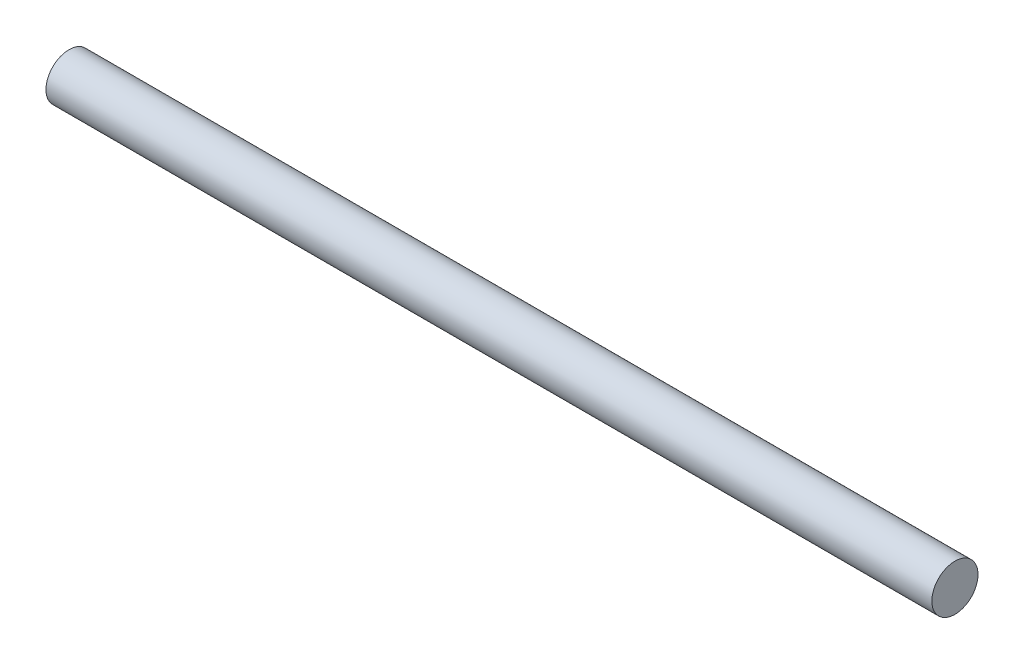
ISO-10303-21;
HEADER;
FILE_DESCRIPTION(('STEP AP214'),'2;1');
FILE_NAME('part.step','',(''),(''),'','','');
FILE_SCHEMA(('AUTOMOTIVE_DESIGN { 1 0 10303 214 1 1 1 1 }'));
ENDSEC;
DATA;
#1=APPLICATION_CONTEXT('core data for automotive mechanical design processes');
#2=APPLICATION_PROTOCOL_DEFINITION('international standard','automotive_design',2000,#1);
#3=PRODUCT_CONTEXT('',#1,'mechanical');
#4=PRODUCT('Part','Part','',(#3));
#5=PRODUCT_RELATED_PRODUCT_CATEGORY('part','',(#4));
#6=PRODUCT_DEFINITION_FORMATION('','',#4);
#7=PRODUCT_DEFINITION_CONTEXT('part definition',#1,'design');
#8=PRODUCT_DEFINITION('design','',#6,#7);
#9=PRODUCT_DEFINITION_SHAPE('','',#8);
#10=(LENGTH_UNIT() NAMED_UNIT(*) SI_UNIT(.MILLI.,.METRE.));
#11=(NAMED_UNIT(*) PLANE_ANGLE_UNIT() SI_UNIT($,.RADIAN.));
#12=(NAMED_UNIT(*) SI_UNIT($,.STERADIAN.) SOLID_ANGLE_UNIT());
#13=UNCERTAINTY_MEASURE_WITH_UNIT(LENGTH_MEASURE(1.E-05),#10,'distance_accuracy_value','');
#14=(GEOMETRIC_REPRESENTATION_CONTEXT(3) GLOBAL_UNCERTAINTY_ASSIGNED_CONTEXT((#13)) GLOBAL_UNIT_ASSIGNED_CONTEXT((#10,
#11,#12)) REPRESENTATION_CONTEXT('',''));
#15=CARTESIAN_POINT('',(0.,0.,0.));
#16=DIRECTION('',(0.,0.,1.));
#17=DIRECTION('',(1.,0.,0.));
#18=AXIS2_PLACEMENT_3D('',#15,#16,#17);
#19=CARTESIAN_POINT('',(96.,0.,0.));
#20=DIRECTION('',(-1.,0.,0.));
#21=DIRECTION('',(0.,0.,1.));
#22=AXIS2_PLACEMENT_3D('',#19,#20,#21);
#23=CYLINDRICAL_SURFACE('',#22,2.5);
#24=CARTESIAN_POINT('',(96.,0.,0.));
#25=DIRECTION('',(1.,0.,0.));
#26=DIRECTION('',(0.,0.,-1.));
#27=AXIS2_PLACEMENT_3D('',#24,#25,#26);
#28=CIRCLE('',#27,2.5);
#29=CARTESIAN_POINT('',(96.,0.,-2.5));
#30=VERTEX_POINT('',#29);
#31=EDGE_CURVE('E10',#30,#30,#28,.T.);
#32=ORIENTED_EDGE('',*,*,#31,.F.);
#33=EDGE_LOOP('',(#32));
#34=FACE_BOUND('',#33,.T.);
#35=CARTESIAN_POINT('',(0.,0.,0.));
#36=DIRECTION('',(1.,0.,0.));
#37=DIRECTION('',(0.,0.,-1.));
#38=AXIS2_PLACEMENT_3D('',#35,#36,#37);
#39=CIRCLE('',#38,2.5);
#40=CARTESIAN_POINT('',(0.,0.,-2.5));
#41=VERTEX_POINT('',#40);
#42=EDGE_CURVE('E40',#41,#41,#39,.T.);
#43=ORIENTED_EDGE('',*,*,#42,.T.);
#44=EDGE_LOOP('',(#43));
#45=FACE_BOUND('',#44,.T.);
#46=ADVANCED_FACE('F37',(#34,#45),#23,.T.);
#47=CARTESIAN_POINT('',(96.,0.,0.));
#48=DIRECTION('',(1.,0.,0.));
#49=DIRECTION('',(0.,0.,-1.));
#50=AXIS2_PLACEMENT_3D('',#47,#48,#49);
#51=PLANE('',#50);
#52=ORIENTED_EDGE('',*,*,#31,.T.);
#53=EDGE_LOOP('',(#52));
#54=FACE_BOUND('',#53,.T.);
#55=ADVANCED_FACE('F54',(#54),#51,.T.);
#56=CARTESIAN_POINT('',(0.,0.,0.));
#57=DIRECTION('',(1.,0.,0.));
#58=DIRECTION('',(0.,0.,-1.));
#59=AXIS2_PLACEMENT_3D('',#56,#57,#58);
#60=PLANE('',#59);
#61=ORIENTED_EDGE('',*,*,#42,.F.);
#62=EDGE_LOOP('',(#61));
#63=FACE_BOUND('',#62,.T.);
#64=ADVANCED_FACE('F52',(#63),#60,.F.);
#65=CLOSED_SHELL('',(#46,#55,#64));
#66=MANIFOLD_SOLID_BREP('B2',#65);
#67=ADVANCED_BREP_SHAPE_REPRESENTATION('',(#18,#66),#14);
#68=SHAPE_DEFINITION_REPRESENTATION(#9,#67);
ENDSEC;
END-ISO-10303-21;
